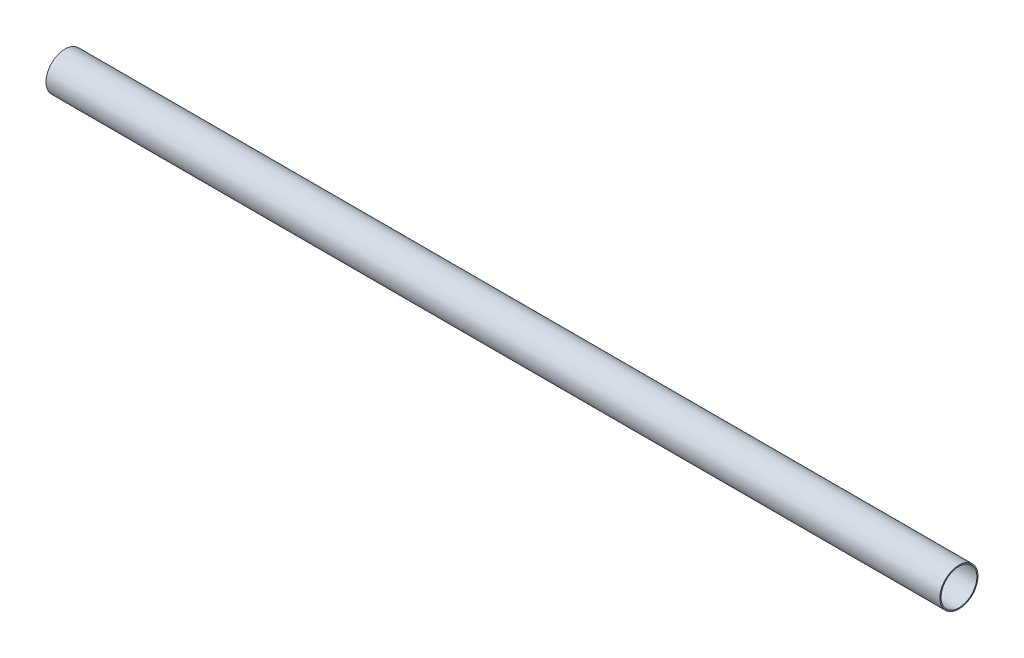
ISO-10303-21;
HEADER;
FILE_DESCRIPTION(('STEP AP214'),'2;1');
FILE_NAME('part.step','',(''),(''),'','','');
FILE_SCHEMA(('AUTOMOTIVE_DESIGN { 1 0 10303 214 1 1 1 1 }'));
ENDSEC;
DATA;
#1=APPLICATION_CONTEXT('core data for automotive mechanical design processes');
#2=APPLICATION_PROTOCOL_DEFINITION('international standard','automotive_design',2000,#1);
#3=PRODUCT_CONTEXT('',#1,'mechanical');
#4=PRODUCT('Part','Part','',(#3));
#5=PRODUCT_RELATED_PRODUCT_CATEGORY('part','',(#4));
#6=PRODUCT_DEFINITION_FORMATION('','',#4);
#7=PRODUCT_DEFINITION_CONTEXT('part definition',#1,'design');
#8=PRODUCT_DEFINITION('design','',#6,#7);
#9=PRODUCT_DEFINITION_SHAPE('','',#8);
#10=(LENGTH_UNIT() NAMED_UNIT(*) SI_UNIT(.MILLI.,.METRE.));
#11=(NAMED_UNIT(*) PLANE_ANGLE_UNIT() SI_UNIT($,.RADIAN.));
#12=(NAMED_UNIT(*) SI_UNIT($,.STERADIAN.) SOLID_ANGLE_UNIT());
#13=UNCERTAINTY_MEASURE_WITH_UNIT(LENGTH_MEASURE(1.E-05),#10,'distance_accuracy_value','');
#14=(GEOMETRIC_REPRESENTATION_CONTEXT(3) GLOBAL_UNCERTAINTY_ASSIGNED_CONTEXT((#13)) GLOBAL_UNIT_ASSIGNED_CONTEXT((#10,
#11,#12)) REPRESENTATION_CONTEXT('',''));
#15=CARTESIAN_POINT('',(0.,0.,0.));
#16=DIRECTION('',(0.,0.,1.));
#17=DIRECTION('',(1.,0.,0.));
#18=AXIS2_PLACEMENT_3D('',#15,#16,#17);
#19=CARTESIAN_POINT('',(1192.,0.,0.));
#20=DIRECTION('',(1.,0.,0.));
#21=DIRECTION('',(0.,0.,-1.));
#22=AXIS2_PLACEMENT_3D('',#19,#20,#21);
#23=PLANE('',#22);
#24=CARTESIAN_POINT('',(1192.,0.,0.));
#25=DIRECTION('',(1.,0.,0.));
#26=DIRECTION('',(0.,0.,-1.));
#27=AXIS2_PLACEMENT_3D('',#24,#25,#26);
#28=CIRCLE('',#27,25.4);
#29=CARTESIAN_POINT('',(1192.,0.,-25.4));
#30=VERTEX_POINT('',#29);
#31=EDGE_CURVE('E10',#30,#30,#28,.T.);
#32=ORIENTED_EDGE('',*,*,#31,.T.);
#33=EDGE_LOOP('',(#32));
#34=FACE_BOUND('',#33,.T.);
#35=CARTESIAN_POINT('',(1192.,0.,0.));
#36=DIRECTION('',(1.,0.,0.));
#37=DIRECTION('',(0.,0.,-1.));
#38=AXIS2_PLACEMENT_3D('',#35,#36,#37);
#39=CIRCLE('',#38,23.9);
#40=CARTESIAN_POINT('',(1192.,0.,-23.9));
#41=VERTEX_POINT('',#40);
#42=EDGE_CURVE('E42',#41,#41,#39,.T.);
#43=ORIENTED_EDGE('',*,*,#42,.F.);
#44=EDGE_LOOP('',(#43));
#45=FACE_BOUND('',#44,.T.);
#46=ADVANCED_FACE('F31',(#34,#45),#23,.T.);
#47=CARTESIAN_POINT('',(0.,0.,0.));
#48=DIRECTION('',(1.,0.,0.));
#49=DIRECTION('',(0.,0.,-1.));
#50=AXIS2_PLACEMENT_3D('',#47,#48,#49);
#51=PLANE('',#50);
#52=CARTESIAN_POINT('',(0.,0.,0.));
#53=DIRECTION('',(1.,0.,0.));
#54=DIRECTION('',(0.,0.,-1.));
#55=AXIS2_PLACEMENT_3D('',#52,#53,#54);
#56=CIRCLE('',#55,25.4);
#57=CARTESIAN_POINT('',(0.,0.,-25.4));
#58=VERTEX_POINT('',#57);
#59=EDGE_CURVE('E35',#58,#58,#56,.T.);
#60=ORIENTED_EDGE('',*,*,#59,.F.);
#61=EDGE_LOOP('',(#60));
#62=FACE_BOUND('',#61,.T.);
#63=CARTESIAN_POINT('',(0.,0.,0.));
#64=DIRECTION('',(1.,0.,0.));
#65=DIRECTION('',(0.,0.,-1.));
#66=AXIS2_PLACEMENT_3D('',#63,#64,#65);
#67=CIRCLE('',#66,23.9);
#68=CARTESIAN_POINT('',(0.,0.,-23.9));
#69=VERTEX_POINT('',#68);
#70=EDGE_CURVE('E44',#69,#69,#67,.T.);
#71=ORIENTED_EDGE('',*,*,#70,.T.);
#72=EDGE_LOOP('',(#71));
#73=FACE_BOUND('',#72,.T.);
#74=ADVANCED_FACE('F54',(#62,#73),#51,.F.);
#75=CARTESIAN_POINT('',(1192.,0.,0.));
#76=DIRECTION('',(-1.,0.,0.));
#77=DIRECTION('',(0.,0.,1.));
#78=AXIS2_PLACEMENT_3D('',#75,#76,#77);
#79=CYLINDRICAL_SURFACE('',#78,25.4);
#80=ORIENTED_EDGE('',*,*,#31,.F.);
#81=EDGE_LOOP('',(#80));
#82=FACE_BOUND('',#81,.T.);
#83=ORIENTED_EDGE('',*,*,#59,.T.);
#84=EDGE_LOOP('',(#83));
#85=FACE_BOUND('',#84,.T.);
#86=ADVANCED_FACE('F33',(#82,#85),#79,.T.);
#87=CARTESIAN_POINT('',(1192.,0.,0.));
#88=DIRECTION('',(-1.,0.,0.));
#89=DIRECTION('',(0.,0.,1.));
#90=AXIS2_PLACEMENT_3D('',#87,#88,#89);
#91=CYLINDRICAL_SURFACE('',#90,23.9);
#92=ORIENTED_EDGE('',*,*,#42,.T.);
#93=EDGE_LOOP('',(#92));
#94=FACE_BOUND('',#93,.T.);
#95=ORIENTED_EDGE('',*,*,#70,.F.);
#96=EDGE_LOOP('',(#95));
#97=FACE_BOUND('',#96,.T.);
#98=ADVANCED_FACE('F50',(#94,#97),#91,.F.);
#99=CLOSED_SHELL('',(#46,#74,#86,#98));
#100=MANIFOLD_SOLID_BREP('B2',#99);
#101=ADVANCED_BREP_SHAPE_REPRESENTATION('',(#18,#100),#14);
#102=SHAPE_DEFINITION_REPRESENTATION(#9,#101);
ENDSEC;
END-ISO-10303-21;
